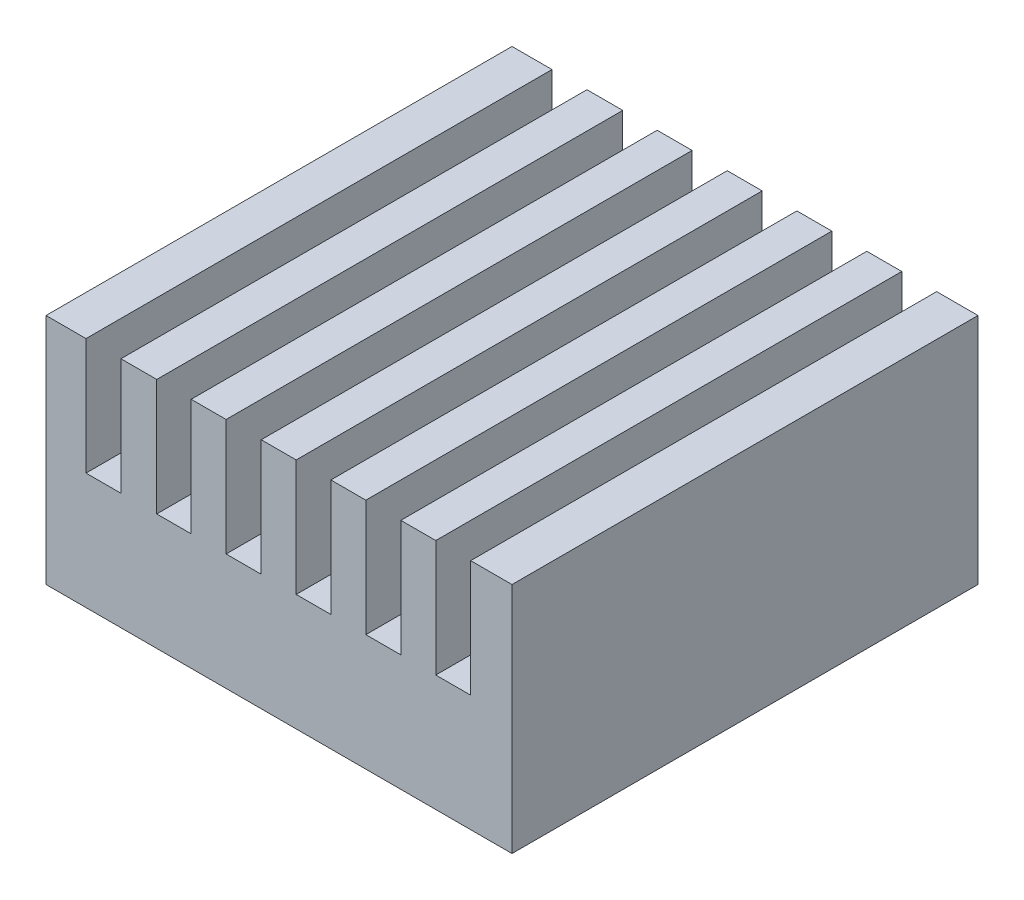
ISO-10303-21;
HEADER;
FILE_DESCRIPTION(('STEP AP214'),'2;1');
FILE_NAME('part.step','',(''),(''),'','','');
FILE_SCHEMA(('AUTOMOTIVE_DESIGN { 1 0 10303 214 1 1 1 1 }'));
ENDSEC;
DATA;
#1=APPLICATION_CONTEXT('core data for automotive mechanical design processes');
#2=APPLICATION_PROTOCOL_DEFINITION('international standard','automotive_design',2000,#1);
#3=PRODUCT_CONTEXT('',#1,'mechanical');
#4=PRODUCT('Part','Part','',(#3));
#5=PRODUCT_RELATED_PRODUCT_CATEGORY('part','',(#4));
#6=PRODUCT_DEFINITION_FORMATION('','',#4);
#7=PRODUCT_DEFINITION_CONTEXT('part definition',#1,'design');
#8=PRODUCT_DEFINITION('design','',#6,#7);
#9=PRODUCT_DEFINITION_SHAPE('','',#8);
#10=(LENGTH_UNIT() NAMED_UNIT(*) SI_UNIT(.MILLI.,.METRE.));
#11=(NAMED_UNIT(*) PLANE_ANGLE_UNIT() SI_UNIT($,.RADIAN.));
#12=(NAMED_UNIT(*) SI_UNIT($,.STERADIAN.) SOLID_ANGLE_UNIT());
#13=UNCERTAINTY_MEASURE_WITH_UNIT(LENGTH_MEASURE(1.E-05),#10,'distance_accuracy_value','');
#14=(GEOMETRIC_REPRESENTATION_CONTEXT(3) GLOBAL_UNCERTAINTY_ASSIGNED_CONTEXT((#13)) GLOBAL_UNIT_ASSIGNED_CONTEXT((#10,
#11,#12)) REPRESENTATION_CONTEXT('',''));
#15=CARTESIAN_POINT('',(0.,0.,0.));
#16=DIRECTION('',(0.,0.,1.));
#17=DIRECTION('',(1.,0.,0.));
#18=AXIS2_PLACEMENT_3D('',#15,#16,#17);
#19=CARTESIAN_POINT('',(28.5340033040011,10.4898974340159,35.0441058699852));
#20=DIRECTION('',(0.,1.,0.));
#21=DIRECTION('',(1.,0.,0.));
#22=AXIS2_PLACEMENT_3D('',#19,#20,#21);
#23=PLANE('',#22);
#24=DIRECTION('',(-1.,0.,0.));
#25=VECTOR('',#24,1.);
#26=CARTESIAN_POINT('',(8.53400330400107,10.4898974340159,15.0441058699852));
#27=LINE('',#26,#25);
#28=CARTESIAN_POINT('',(48.5340033040011,10.4898974340159,15.0441058699852));
#29=VERTEX_POINT('',#28);
#30=CARTESIAN_POINT('',(8.53400330400107,10.4898974340159,15.0441058699852));
#31=VERTEX_POINT('',#30);
#32=EDGE_CURVE('E21',#29,#31,#27,.T.);
#33=ORIENTED_EDGE('',*,*,#32,.F.);
#34=DIRECTION('',(0.,0.,-1.));
#35=VECTOR('',#34,1.);
#36=CARTESIAN_POINT('',(48.5340033040011,10.4898974340159,55.0441058699852));
#37=LINE('',#36,#35);
#38=CARTESIAN_POINT('',(48.5340033040011,10.4898974340159,55.0441058699852));
#39=VERTEX_POINT('',#38);
#40=EDGE_CURVE('E349',#39,#29,#37,.T.);
#41=ORIENTED_EDGE('',*,*,#40,.F.);
#42=DIRECTION('',(1.,0.,0.));
#43=VECTOR('',#42,1.);
#44=CARTESIAN_POINT('',(8.53400330400108,10.4898974340159,55.0441058699852));
#45=LINE('',#44,#43);
#46=CARTESIAN_POINT('',(8.53400330400108,10.4898974340159,55.0441058699852));
#47=VERTEX_POINT('',#46);
#48=EDGE_CURVE('E28',#47,#39,#45,.T.);
#49=ORIENTED_EDGE('',*,*,#48,.F.);
#50=DIRECTION('',(0.,0.,1.));
#51=VECTOR('',#50,1.);
#52=CARTESIAN_POINT('',(8.53400330400108,10.4898974340159,55.0441058699852));
#53=LINE('',#52,#51);
#54=EDGE_CURVE('E11',#31,#47,#53,.T.);
#55=ORIENTED_EDGE('',*,*,#54,.F.);
#56=EDGE_LOOP('',(#33,#41,#49,#55));
#57=FACE_BOUND('',#56,.T.);
#58=ADVANCED_FACE('F17',(#57),#23,.F.);
#59=CARTESIAN_POINT('',(28.5340033040011,30.4898974340159,35.0441058699852));
#60=DIRECTION('',(0.,1.,0.));
#61=DIRECTION('',(1.,0.,0.));
#62=AXIS2_PLACEMENT_3D('',#59,#60,#61);
#63=PLANE('',#62);
#64=DIRECTION('',(0.,0.,-1.));
#65=VECTOR('',#64,1.);
#66=CARTESIAN_POINT('',(23.9942961256802,30.4898974340159,25.0441058699852));
#67=LINE('',#66,#65);
#68=CARTESIAN_POINT('',(23.9942961256802,30.4898974340152,55.0441058699852));
#69=VERTEX_POINT('',#68);
#70=CARTESIAN_POINT('',(23.9942961256802,30.4898974340159,15.0441058699852));
#71=VERTEX_POINT('',#70);
#72=EDGE_CURVE('E509',#69,#71,#67,.T.);
#73=ORIENTED_EDGE('',*,*,#72,.T.);
#74=DIRECTION('',(-1.,0.,0.));
#75=VECTOR('',#74,1.);
#76=CARTESIAN_POINT('',(8.53400330400108,30.4898974340159,15.0441058699852));
#77=LINE('',#76,#75);
#78=CARTESIAN_POINT('',(20.9942961256802,30.4898974340152,15.0441058699852));
#79=VERTEX_POINT('',#78);
#80=EDGE_CURVE('E411',#71,#79,#77,.T.);
#81=ORIENTED_EDGE('',*,*,#80,.T.);
#82=DIRECTION('',(0.,0.,1.));
#83=VECTOR('',#82,1.);
#84=CARTESIAN_POINT('',(20.9942961256802,30.4898974340159,45.0441058699852));
#85=LINE('',#84,#83);
#86=CARTESIAN_POINT('',(20.9942961256802,30.4898974340152,55.0441058699852));
#87=VERTEX_POINT('',#86);
#88=EDGE_CURVE('E258',#79,#87,#85,.T.);
#89=ORIENTED_EDGE('',*,*,#88,.T.);
#90=DIRECTION('',(1.,0.,0.));
#91=VECTOR('',#90,1.);
#92=CARTESIAN_POINT('',(8.53400330400109,30.4898974340159,55.0441058699852));
#93=LINE('',#92,#91);
#94=EDGE_CURVE('E415',#87,#69,#93,.T.);
#95=ORIENTED_EDGE('',*,*,#94,.T.);
#96=EDGE_LOOP('',(#73,#81,#89,#95));
#97=FACE_BOUND('',#96,.T.);
#98=ADVANCED_FACE('F654',(#97),#63,.T.);
#99=CARTESIAN_POINT('',(8.53400330400108,10.4898974340159,15.0441058699852));
#100=DIRECTION('',(-1.,0.,0.));
#101=DIRECTION('',(0.,0.,1.));
#102=AXIS2_PLACEMENT_3D('',#99,#100,#101);
#103=PLANE('',#102);
#104=ORIENTED_EDGE('',*,*,#54,.T.);
#105=DIRECTION('',(0.,1.,0.));
#106=VECTOR('',#105,1.);
#107=CARTESIAN_POINT('',(8.53400330400108,10.4898974340159,55.0441058699852));
#108=LINE('',#107,#106);
#109=CARTESIAN_POINT('',(8.53400330400109,30.4898974340159,55.0441058699852));
#110=VERTEX_POINT('',#109);
#111=EDGE_CURVE('E359',#47,#110,#108,.T.);
#112=ORIENTED_EDGE('',*,*,#111,.T.);
#113=DIRECTION('',(0.,0.,1.));
#114=VECTOR('',#113,1.);
#115=CARTESIAN_POINT('',(8.53400330400109,30.4898974340159,55.0441058699852));
#116=LINE('',#115,#114);
#117=CARTESIAN_POINT('',(8.53400330400108,30.4898974340159,15.0441058699852));
#118=VERTEX_POINT('',#117);
#119=EDGE_CURVE('E340',#118,#110,#116,.T.);
#120=ORIENTED_EDGE('',*,*,#119,.F.);
#121=DIRECTION('',(0.,1.,0.));
#122=VECTOR('',#121,1.);
#123=CARTESIAN_POINT('',(8.53400330400107,10.4898974340159,15.0441058699852));
#124=LINE('',#123,#122);
#125=EDGE_CURVE('E294',#31,#118,#124,.T.);
#126=ORIENTED_EDGE('',*,*,#125,.F.);
#127=EDGE_LOOP('',(#104,#112,#120,#126));
#128=FACE_BOUND('',#127,.T.);
#129=ADVANCED_FACE('F917',(#128),#103,.T.);
#130=CARTESIAN_POINT('',(8.53400330400108,10.4898974340159,55.0441058699852));
#131=DIRECTION('',(0.,0.,1.));
#132=DIRECTION('',(1.,0.,0.));
#133=AXIS2_PLACEMENT_3D('',#130,#131,#132);
#134=PLANE('',#133);
#135=DIRECTION('',(0.,1.,0.));
#136=VECTOR('',#135,1.);
#137=CARTESIAN_POINT('',(23.9942961256801,15.4898974340159,55.0441058699852));
#138=LINE('',#137,#136);
#139=CARTESIAN_POINT('',(23.9942961256802,20.4898974340152,55.0441058699852));
#140=VERTEX_POINT('',#139);
#141=EDGE_CURVE('E463',#140,#69,#138,.T.);
#142=ORIENTED_EDGE('',*,*,#141,.T.);
#143=ORIENTED_EDGE('',*,*,#94,.F.);
#144=DIRECTION('',(0.,-1.,0.));
#145=VECTOR('',#144,1.);
#146=CARTESIAN_POINT('',(20.9942961256801,15.4898974340155,55.0441058699852));
#147=LINE('',#146,#145);
#148=CARTESIAN_POINT('',(20.9942961256802,20.4898974340152,55.0441058699852));
#149=VERTEX_POINT('',#148);
#150=EDGE_CURVE('E262',#87,#149,#147,.T.);
#151=ORIENTED_EDGE('',*,*,#150,.T.);
#152=DIRECTION('',(-1.,0.,0.));
#153=VECTOR('',#152,1.);
#154=CARTESIAN_POINT('',(14.0256667687704,20.4898974340159,55.0441058699852));
#155=LINE('',#154,#153);
#156=CARTESIAN_POINT('',(18.0403643413993,20.4898974340159,55.0441058699852));
#157=VERTEX_POINT('',#156);
#158=EDGE_CURVE('E264',#149,#157,#155,.T.);
#159=ORIENTED_EDGE('',*,*,#158,.T.);
#160=DIRECTION('',(0.,1.,0.));
#161=VECTOR('',#160,1.);
#162=CARTESIAN_POINT('',(18.0403643413993,15.4898974340159,55.0441058699852));
#163=LINE('',#162,#161);
#164=CARTESIAN_POINT('',(18.0403643413993,30.4898974340159,55.0441058699852));
#165=VERTEX_POINT('',#164);
#166=EDGE_CURVE('E366',#157,#165,#163,.T.);
#167=ORIENTED_EDGE('',*,*,#166,.T.);
#168=DIRECTION('',(1.,0.,0.));
#169=VECTOR('',#168,1.);
#170=CARTESIAN_POINT('',(8.53400330400109,30.4898974340159,55.0441058699852));
#171=LINE('',#170,#169);
#172=CARTESIAN_POINT('',(14.9676477439526,30.4898974340159,55.0441058699852));
#173=VERTEX_POINT('',#172);
#174=EDGE_CURVE('E345',#173,#165,#171,.T.);
#175=ORIENTED_EDGE('',*,*,#174,.F.);
#176=DIRECTION('',(0.,-1.,0.));
#177=VECTOR('',#176,1.);
#178=CARTESIAN_POINT('',(14.9676477439526,15.4898974340159,55.0441058699852));
#179=LINE('',#178,#177);
#180=CARTESIAN_POINT('',(14.9676477439526,20.4898974340159,55.0441058699852));
#181=VERTEX_POINT('',#180);
#182=EDGE_CURVE('E252',#173,#181,#179,.T.);
#183=ORIENTED_EDGE('',*,*,#182,.T.);
#184=DIRECTION('',(-1.,0.,0.));
#185=VECTOR('',#184,1.);
#186=CARTESIAN_POINT('',(11.0008255239768,20.4898974340159,55.0441058699852));
#187=LINE('',#186,#185);
#188=CARTESIAN_POINT('',(11.9676477439526,20.4898974340159,55.0441058699852));
#189=VERTEX_POINT('',#188);
#190=EDGE_CURVE('E396',#181,#189,#187,.T.);
#191=ORIENTED_EDGE('',*,*,#190,.T.);
#192=DIRECTION('',(0.,1.,0.));
#193=VECTOR('',#192,1.);
#194=CARTESIAN_POINT('',(11.9676477439526,15.4898974340159,55.0441058699852));
#195=LINE('',#194,#193);
#196=CARTESIAN_POINT('',(11.9676477439526,30.4898974340159,55.0441058699852));
#197=VERTEX_POINT('',#196);
#198=EDGE_CURVE('E253',#189,#197,#195,.T.);
#199=ORIENTED_EDGE('',*,*,#198,.T.);
#200=DIRECTION('',(1.,0.,0.));
#201=VECTOR('',#200,1.);
#202=CARTESIAN_POINT('',(8.53400330400109,30.4898974340159,55.0441058699852));
#203=LINE('',#202,#201);
#204=EDGE_CURVE('E344',#110,#197,#203,.T.);
#205=ORIENTED_EDGE('',*,*,#204,.F.);
#206=ORIENTED_EDGE('',*,*,#111,.F.);
#207=ORIENTED_EDGE('',*,*,#48,.T.);
#208=DIRECTION('',(0.,1.,0.));
#209=VECTOR('',#208,1.);
#210=CARTESIAN_POINT('',(48.5340033040011,10.4898974340159,55.0441058699852));
#211=LINE('',#210,#209);
#212=CARTESIAN_POINT('',(48.5340033040011,30.4898974340159,55.0441058699852));
#213=VERTEX_POINT('',#212);
#214=EDGE_CURVE('E352',#39,#213,#211,.T.);
#215=ORIENTED_EDGE('',*,*,#214,.T.);
#216=DIRECTION('',(1.,0.,0.));
#217=VECTOR('',#216,1.);
#218=CARTESIAN_POINT('',(8.53400330400109,30.4898974340159,55.0441058699852));
#219=LINE('',#218,#217);
#220=CARTESIAN_POINT('',(44.9859385745514,30.4898974340156,55.0441058699852));
#221=VERTEX_POINT('',#220);
#222=EDGE_CURVE('E388',#221,#213,#219,.T.);
#223=ORIENTED_EDGE('',*,*,#222,.F.);
#224=DIRECTION('',(0.,-1.,0.));
#225=VECTOR('',#224,1.);
#226=CARTESIAN_POINT('',(44.9859385745514,15.4898974340157,55.0441058699852));
#227=LINE('',#226,#225);
#228=CARTESIAN_POINT('',(44.9859385745514,20.4898974340156,55.0441058699852));
#229=VERTEX_POINT('',#228);
#230=EDGE_CURVE('E232',#221,#229,#227,.T.);
#231=ORIENTED_EDGE('',*,*,#230,.T.);
#232=DIRECTION('',(-1.,0.,0.));
#233=VECTOR('',#232,1.);
#234=CARTESIAN_POINT('',(26.0113039152153,20.4898974340159,55.0441058699852));
#235=LINE('',#234,#233);
#236=CARTESIAN_POINT('',(41.9912704783078,20.4898974340157,55.0441058699852));
#237=VERTEX_POINT('',#236);
#238=EDGE_CURVE('E218',#229,#237,#235,.T.);
#239=ORIENTED_EDGE('',*,*,#238,.T.);
#240=DIRECTION('',(0.,1.,0.));
#241=VECTOR('',#240,1.);
#242=CARTESIAN_POINT('',(41.9912704783078,15.4898974340158,55.0441058699852));
#243=LINE('',#242,#241);
#244=CARTESIAN_POINT('',(41.9912704783078,30.4898974340157,55.0441058699852));
#245=VERTEX_POINT('',#244);
#246=EDGE_CURVE('E233',#237,#245,#243,.T.);
#247=ORIENTED_EDGE('',*,*,#246,.T.);
#248=DIRECTION('',(1.,0.,0.));
#249=VECTOR('',#248,1.);
#250=CARTESIAN_POINT('',(8.53400330400109,30.4898974340159,55.0441058699852));
#251=LINE('',#250,#249);
#252=CARTESIAN_POINT('',(38.9912704783078,30.4898974340157,55.0441058699852));
#253=VERTEX_POINT('',#252);
#254=EDGE_CURVE('E348',#253,#245,#251,.T.);
#255=ORIENTED_EDGE('',*,*,#254,.F.);
#256=DIRECTION('',(0.,-1.,0.));
#257=VECTOR('',#256,1.);
#258=CARTESIAN_POINT('',(38.9912704783078,15.4898974340158,55.0441058699852));
#259=LINE('',#258,#257);
#260=CARTESIAN_POINT('',(38.9912704783078,20.4898974340157,55.0441058699852));
#261=VERTEX_POINT('',#260);
#262=EDGE_CURVE('E312',#253,#261,#259,.T.);
#263=ORIENTED_EDGE('',*,*,#262,.T.);
#264=DIRECTION('',(-1.,0.,0.));
#265=VECTOR('',#264,1.);
#266=CARTESIAN_POINT('',(23.0116728195443,20.4898974340159,55.0441058699852));
#267=LINE('',#266,#265);
#268=CARTESIAN_POINT('',(35.9874141918673,20.4898974340159,55.0441058699852));
#269=VERTEX_POINT('',#268);
#270=EDGE_CURVE('E309',#261,#269,#267,.T.);
#271=ORIENTED_EDGE('',*,*,#270,.T.);
#272=DIRECTION('',(0.,1.,0.));
#273=VECTOR('',#272,1.);
#274=CARTESIAN_POINT('',(35.9874141918673,15.4898974340159,55.0441058699852));
#275=LINE('',#274,#273);
#276=CARTESIAN_POINT('',(35.9874141918673,30.4898974340159,55.0441058699852));
#277=VERTEX_POINT('',#276);
#278=EDGE_CURVE('E485',#269,#277,#275,.T.);
#279=ORIENTED_EDGE('',*,*,#278,.T.);
#280=DIRECTION('',(1.,0.,0.));
#281=VECTOR('',#280,1.);
#282=CARTESIAN_POINT('',(8.53400330400109,30.4898974340159,55.0441058699852));
#283=LINE('',#282,#281);
#284=CARTESIAN_POINT('',(32.9874141918673,30.4898974340159,55.0441058699852));
#285=VERTEX_POINT('',#284);
#286=EDGE_CURVE('E434',#285,#277,#283,.T.);
#287=ORIENTED_EDGE('',*,*,#286,.F.);
#288=DIRECTION('',(0.,-1.,0.));
#289=VECTOR('',#288,1.);
#290=CARTESIAN_POINT('',(32.9874141918673,15.4898974340159,55.0441058699852));
#291=LINE('',#290,#289);
#292=CARTESIAN_POINT('',(32.9874141918673,20.4898974340159,55.0441058699852));
#293=VERTEX_POINT('',#292);
#294=EDGE_CURVE('E455',#285,#293,#291,.T.);
#295=ORIENTED_EDGE('',*,*,#294,.T.);
#296=DIRECTION('',(-1.,0.,0.));
#297=VECTOR('',#296,1.);
#298=CARTESIAN_POINT('',(20.0160778580608,20.4898974340159,55.0441058699852));
#299=LINE('',#298,#297);
#300=CARTESIAN_POINT('',(30.0088906323739,20.4898974340159,55.0441058699852));
#301=VERTEX_POINT('',#300);
#302=EDGE_CURVE('E276',#293,#301,#299,.T.);
#303=ORIENTED_EDGE('',*,*,#302,.T.);
#304=DIRECTION('',(0.,1.,0.));
#305=VECTOR('',#304,1.);
#306=CARTESIAN_POINT('',(30.0088906323739,15.4898974340159,55.0441058699852));
#307=LINE('',#306,#305);
#308=CARTESIAN_POINT('',(30.0088906323739,30.4898974340159,55.0441058699852));
#309=VERTEX_POINT('',#308);
#310=EDGE_CURVE('E381',#301,#309,#307,.T.);
#311=ORIENTED_EDGE('',*,*,#310,.T.);
#312=DIRECTION('',(1.,0.,0.));
#313=VECTOR('',#312,1.);
#314=CARTESIAN_POINT('',(8.53400330400109,30.4898974340159,55.0441058699852));
#315=LINE('',#314,#313);
#316=CARTESIAN_POINT('',(27.0088906323739,30.4898974340159,55.0441058699852));
#317=VERTEX_POINT('',#316);
#318=EDGE_CURVE('E431',#317,#309,#315,.T.);
#319=ORIENTED_EDGE('',*,*,#318,.F.);
#320=DIRECTION('',(0.,-1.,0.));
#321=VECTOR('',#320,1.);
#322=CARTESIAN_POINT('',(27.0088906323739,15.4898974340159,55.0441058699852));
#323=LINE('',#322,#321);
#324=CARTESIAN_POINT('',(27.0088906323739,20.4898974340159,55.0441058699852));
#325=VERTEX_POINT('',#324);
#326=EDGE_CURVE('E365',#317,#325,#323,.T.);
#327=ORIENTED_EDGE('',*,*,#326,.T.);
#328=DIRECTION('',(-1.,0.,0.));
#329=VECTOR('',#328,1.);
#330=CARTESIAN_POINT('',(17.0177983415141,20.4898974340159,55.0441058699852));
#331=LINE('',#330,#329);
#332=EDGE_CURVE('E377',#325,#140,#331,.T.);
#333=ORIENTED_EDGE('',*,*,#332,.T.);
#334=EDGE_LOOP('',(#142,#143,#151,#159,#167,#175,#183,#191,#199,#205,#206,#207,#215,#223,#231,
#239,#247,#255,#263,#271,#279,#287,#295,#303,#311,#319,#327,#333));
#335=FACE_BOUND('',#334,.T.);
#336=ADVANCED_FACE('F576',(#335),#134,.T.);
#337=CARTESIAN_POINT('',(48.5340033040011,10.4898974340159,55.0441058699852));
#338=DIRECTION('',(1.,0.,0.));
#339=DIRECTION('',(0.,-1.,0.));
#340=AXIS2_PLACEMENT_3D('',#337,#338,#339);
#341=PLANE('',#340);
#342=ORIENTED_EDGE('',*,*,#40,.T.);
#343=DIRECTION('',(0.,1.,0.));
#344=VECTOR('',#343,1.);
#345=CARTESIAN_POINT('',(48.5340033040011,10.4898974340159,15.0441058699852));
#346=LINE('',#345,#344);
#347=CARTESIAN_POINT('',(48.5340033040011,30.4898974340159,15.0441058699852));
#348=VERTEX_POINT('',#347);
#349=EDGE_CURVE('E471',#29,#348,#346,.T.);
#350=ORIENTED_EDGE('',*,*,#349,.T.);
#351=DIRECTION('',(0.,0.,-1.));
#352=VECTOR('',#351,1.);
#353=CARTESIAN_POINT('',(48.5340033040011,30.4898974340159,55.0441058699852));
#354=LINE('',#353,#352);
#355=EDGE_CURVE('E353',#213,#348,#354,.T.);
#356=ORIENTED_EDGE('',*,*,#355,.F.);
#357=ORIENTED_EDGE('',*,*,#214,.F.);
#358=EDGE_LOOP('',(#342,#350,#356,#357));
#359=FACE_BOUND('',#358,.T.);
#360=ADVANCED_FACE('F580',(#359),#341,.T.);
#361=CARTESIAN_POINT('',(28.5340033040011,30.4898974340159,35.0441058699852));
#362=DIRECTION('',(0.,1.,0.));
#363=DIRECTION('',(1.,0.,0.));
#364=AXIS2_PLACEMENT_3D('',#361,#362,#363);
#365=PLANE('',#364);
#366=DIRECTION('',(0.,0.,1.));
#367=VECTOR('',#366,1.);
#368=CARTESIAN_POINT('',(44.9859385745514,30.4898974340159,45.0441058699852));
#369=LINE('',#368,#367);
#370=CARTESIAN_POINT('',(44.9859385745514,30.4898974340155,15.0441058699852));
#371=VERTEX_POINT('',#370);
#372=EDGE_CURVE('E226',#371,#221,#369,.T.);
#373=ORIENTED_EDGE('',*,*,#372,.T.);
#374=ORIENTED_EDGE('',*,*,#222,.T.);
#375=ORIENTED_EDGE('',*,*,#355,.T.);
#376=DIRECTION('',(-1.,0.,0.));
#377=VECTOR('',#376,1.);
#378=CARTESIAN_POINT('',(8.53400330400108,30.4898974340159,15.0441058699852));
#379=LINE('',#378,#377);
#380=EDGE_CURVE('E474',#348,#371,#379,.T.);
#381=ORIENTED_EDGE('',*,*,#380,.T.);
#382=EDGE_LOOP('',(#373,#374,#375,#381));
#383=FACE_BOUND('',#382,.T.);
#384=ADVANCED_FACE('F583',(#383),#365,.T.);
#385=CARTESIAN_POINT('',(28.5340033040011,30.4898974340159,35.0441058699852));
#386=DIRECTION('',(0.,1.,0.));
#387=DIRECTION('',(1.,0.,0.));
#388=AXIS2_PLACEMENT_3D('',#385,#386,#387);
#389=PLANE('',#388);
#390=DIRECTION('',(0.,0.,1.));
#391=VECTOR('',#390,1.);
#392=CARTESIAN_POINT('',(27.0088906323739,30.4898974340159,45.0441058699852));
#393=LINE('',#392,#391);
#394=CARTESIAN_POINT('',(27.0088906323739,30.4898974340159,15.0441058699852));
#395=VERTEX_POINT('',#394);
#396=EDGE_CURVE('E360',#395,#317,#393,.T.);
#397=ORIENTED_EDGE('',*,*,#396,.T.);
#398=ORIENTED_EDGE('',*,*,#318,.T.);
#399=DIRECTION('',(0.,0.,-1.));
#400=VECTOR('',#399,1.);
#401=CARTESIAN_POINT('',(30.0088906323739,30.4898974340159,25.0441058699852));
#402=LINE('',#401,#400);
#403=CARTESIAN_POINT('',(30.0088906323739,30.4898974340159,15.0441058699852));
#404=VERTEX_POINT('',#403);
#405=EDGE_CURVE('E330',#309,#404,#402,.T.);
#406=ORIENTED_EDGE('',*,*,#405,.T.);
#407=DIRECTION('',(-1.,0.,0.));
#408=VECTOR('',#407,1.);
#409=CARTESIAN_POINT('',(8.53400330400108,30.4898974340159,15.0441058699852));
#410=LINE('',#409,#408);
#411=EDGE_CURVE('E395',#404,#395,#410,.T.);
#412=ORIENTED_EDGE('',*,*,#411,.T.);
#413=EDGE_LOOP('',(#397,#398,#406,#412));
#414=FACE_BOUND('',#413,.T.);
#415=ADVANCED_FACE('F940',(#414),#389,.T.);
#416=CARTESIAN_POINT('',(28.5340033040011,30.4898974340159,35.0441058699852));
#417=DIRECTION('',(0.,1.,0.));
#418=DIRECTION('',(1.,0.,0.));
#419=AXIS2_PLACEMENT_3D('',#416,#417,#418);
#420=PLANE('',#419);
#421=DIRECTION('',(0.,0.,1.));
#422=VECTOR('',#421,1.);
#423=CARTESIAN_POINT('',(32.9874141918673,30.4898974340159,45.0441058699852));
#424=LINE('',#423,#422);
#425=CARTESIAN_POINT('',(32.9874141918673,30.4898974340159,15.0441058699852));
#426=VERTEX_POINT('',#425);
#427=EDGE_CURVE('E428',#426,#285,#424,.T.);
#428=ORIENTED_EDGE('',*,*,#427,.T.);
#429=ORIENTED_EDGE('',*,*,#286,.T.);
#430=DIRECTION('',(0.,0.,-1.));
#431=VECTOR('',#430,1.);
#432=CARTESIAN_POINT('',(35.9874141918673,30.4898974340159,25.0441058699852));
#433=LINE('',#432,#431);
#434=CARTESIAN_POINT('',(35.9874141918673,30.4898974340159,15.0441058699852));
#435=VERTEX_POINT('',#434);
#436=EDGE_CURVE('E246',#277,#435,#433,.T.);
#437=ORIENTED_EDGE('',*,*,#436,.T.);
#438=DIRECTION('',(-1.,0.,0.));
#439=VECTOR('',#438,1.);
#440=CARTESIAN_POINT('',(8.53400330400108,30.4898974340159,15.0441058699852));
#441=LINE('',#440,#439);
#442=EDGE_CURVE('E470',#435,#426,#441,.T.);
#443=ORIENTED_EDGE('',*,*,#442,.T.);
#444=EDGE_LOOP('',(#428,#429,#437,#443));
#445=FACE_BOUND('',#444,.T.);
#446=ADVANCED_FACE('F880',(#445),#420,.T.);
#447=CARTESIAN_POINT('',(28.5340033040011,30.4898974340159,35.0441058699852));
#448=DIRECTION('',(0.,1.,0.));
#449=DIRECTION('',(1.,0.,0.));
#450=AXIS2_PLACEMENT_3D('',#447,#448,#449);
#451=PLANE('',#450);
#452=DIRECTION('',(0.,0.,-1.));
#453=VECTOR('',#452,1.);
#454=CARTESIAN_POINT('',(41.9912704783078,30.4898974340159,25.0441058699852));
#455=LINE('',#454,#453);
#456=CARTESIAN_POINT('',(41.9912704783078,30.4898974340157,15.0441058699852));
#457=VERTEX_POINT('',#456);
#458=EDGE_CURVE('E242',#245,#457,#455,.T.);
#459=ORIENTED_EDGE('',*,*,#458,.T.);
#460=DIRECTION('',(-1.,0.,0.));
#461=VECTOR('',#460,1.);
#462=CARTESIAN_POINT('',(8.53400330400108,30.4898974340159,15.0441058699852));
#463=LINE('',#462,#461);
#464=CARTESIAN_POINT('',(38.9912704783078,30.4898974340159,15.0441058699852));
#465=VERTEX_POINT('',#464);
#466=EDGE_CURVE('E324',#457,#465,#463,.T.);
#467=ORIENTED_EDGE('',*,*,#466,.T.);
#468=DIRECTION('',(0.,0.,1.));
#469=VECTOR('',#468,1.);
#470=CARTESIAN_POINT('',(38.9912704783078,30.4898974340159,45.0441058699852));
#471=LINE('',#470,#469);
#472=EDGE_CURVE('E302',#465,#253,#471,.T.);
#473=ORIENTED_EDGE('',*,*,#472,.T.);
#474=ORIENTED_EDGE('',*,*,#254,.T.);
#475=EDGE_LOOP('',(#459,#467,#473,#474));
#476=FACE_BOUND('',#475,.T.);
#477=ADVANCED_FACE('F589',(#476),#451,.T.);
#478=CARTESIAN_POINT('',(28.5340033040011,30.4898974340159,35.0441058699852));
#479=DIRECTION('',(0.,1.,0.));
#480=DIRECTION('',(1.,0.,0.));
#481=AXIS2_PLACEMENT_3D('',#478,#479,#480);
#482=PLANE('',#481);
#483=DIRECTION('',(0.,0.,-1.));
#484=VECTOR('',#483,1.);
#485=CARTESIAN_POINT('',(11.9676477439526,30.4898974340159,25.0441058699852));
#486=LINE('',#485,#484);
#487=CARTESIAN_POINT('',(11.9676477439526,30.4898974340159,15.0441058699852));
#488=VERTEX_POINT('',#487);
#489=EDGE_CURVE('E334',#197,#488,#486,.T.);
#490=ORIENTED_EDGE('',*,*,#489,.T.);
#491=DIRECTION('',(-1.,0.,0.));
#492=VECTOR('',#491,1.);
#493=CARTESIAN_POINT('',(8.53400330400108,30.4898974340159,15.0441058699852));
#494=LINE('',#493,#492);
#495=EDGE_CURVE('E297',#488,#118,#494,.T.);
#496=ORIENTED_EDGE('',*,*,#495,.T.);
#497=ORIENTED_EDGE('',*,*,#119,.T.);
#498=ORIENTED_EDGE('',*,*,#204,.T.);
#499=EDGE_LOOP('',(#490,#496,#497,#498));
#500=FACE_BOUND('',#499,.T.);
#501=ADVANCED_FACE('F619',(#500),#482,.T.);
#502=CARTESIAN_POINT('',(28.5340033040011,30.4898974340159,35.0441058699852));
#503=DIRECTION('',(0.,1.,0.));
#504=DIRECTION('',(1.,0.,0.));
#505=AXIS2_PLACEMENT_3D('',#502,#503,#504);
#506=PLANE('',#505);
#507=DIRECTION('',(0.,0.,-1.));
#508=VECTOR('',#507,1.);
#509=CARTESIAN_POINT('',(18.0403643413993,30.4898974340159,25.0441058699852));
#510=LINE('',#509,#508);
#511=CARTESIAN_POINT('',(18.0403643413993,30.4898974340159,15.0441058699852));
#512=VERTEX_POINT('',#511);
#513=EDGE_CURVE('E370',#165,#512,#510,.T.);
#514=ORIENTED_EDGE('',*,*,#513,.T.);
#515=DIRECTION('',(-1.,0.,0.));
#516=VECTOR('',#515,1.);
#517=CARTESIAN_POINT('',(8.53400330400108,30.4898974340159,15.0441058699852));
#518=LINE('',#517,#516);
#519=CARTESIAN_POINT('',(14.9676477439526,30.4898974340159,15.0441058699852));
#520=VERTEX_POINT('',#519);
#521=EDGE_CURVE('E408',#512,#520,#518,.T.);
#522=ORIENTED_EDGE('',*,*,#521,.T.);
#523=DIRECTION('',(0.,0.,1.));
#524=VECTOR('',#523,1.);
#525=CARTESIAN_POINT('',(14.9676477439526,30.4898974340159,45.0441058699852));
#526=LINE('',#525,#524);
#527=EDGE_CURVE('E293',#520,#173,#526,.T.);
#528=ORIENTED_EDGE('',*,*,#527,.T.);
#529=ORIENTED_EDGE('',*,*,#174,.T.);
#530=EDGE_LOOP('',(#514,#522,#528,#529));
#531=FACE_BOUND('',#530,.T.);
#532=ADVANCED_FACE('F853',(#531),#506,.T.);
#533=CARTESIAN_POINT('',(48.5340033040011,10.4898974340159,15.0441058699852));
#534=DIRECTION('',(0.,0.,-1.));
#535=DIRECTION('',(-1.,0.,0.));
#536=AXIS2_PLACEMENT_3D('',#533,#534,#535);
#537=PLANE('',#536);
#538=DIRECTION('',(0.,-1.,0.));
#539=VECTOR('',#538,1.);
#540=CARTESIAN_POINT('',(23.9942961256801,15.4898974340159,15.0441058699852));
#541=LINE('',#540,#539);
#542=CARTESIAN_POINT('',(23.9942961256802,20.4898974340159,15.0441058699852));
#543=VERTEX_POINT('',#542);
#544=EDGE_CURVE('E424',#71,#543,#541,.T.);
#545=ORIENTED_EDGE('',*,*,#544,.T.);
#546=DIRECTION('',(1.,0.,0.));
#547=VECTOR('',#546,1.);
#548=CARTESIAN_POINT('',(37.017798341514,20.4898974340166,15.0441058699852));
#549=LINE('',#548,#547);
#550=CARTESIAN_POINT('',(27.0088906323739,20.4898974340159,15.0441058699852));
#551=VERTEX_POINT('',#550);
#552=EDGE_CURVE('E257',#543,#551,#549,.T.);
#553=ORIENTED_EDGE('',*,*,#552,.T.);
#554=DIRECTION('',(0.,1.,0.));
#555=VECTOR('',#554,1.);
#556=CARTESIAN_POINT('',(27.0088906323739,15.4898974340159,15.0441058699852));
#557=LINE('',#556,#555);
#558=EDGE_CURVE('E364',#551,#395,#557,.T.);
#559=ORIENTED_EDGE('',*,*,#558,.T.);
#560=ORIENTED_EDGE('',*,*,#411,.F.);
#561=DIRECTION('',(0.,-1.,0.));
#562=VECTOR('',#561,1.);
#563=CARTESIAN_POINT('',(30.0088906323739,15.4898974340159,15.0441058699852));
#564=LINE('',#563,#562);
#565=CARTESIAN_POINT('',(30.0088906323739,20.4898974340159,15.0441058699852));
#566=VERTEX_POINT('',#565);
#567=EDGE_CURVE('E326',#404,#566,#564,.T.);
#568=ORIENTED_EDGE('',*,*,#567,.T.);
#569=DIRECTION('',(1.,0.,0.));
#570=VECTOR('',#569,1.);
#571=CARTESIAN_POINT('',(40.0160778580608,20.4898974340159,15.0441058699852));
#572=LINE('',#571,#570);
#573=CARTESIAN_POINT('',(32.9874141918673,20.4898974340159,15.0441058699852));
#574=VERTEX_POINT('',#573);
#575=EDGE_CURVE('E272',#566,#574,#572,.T.);
#576=ORIENTED_EDGE('',*,*,#575,.T.);
#577=DIRECTION('',(0.,1.,0.));
#578=VECTOR('',#577,1.);
#579=CARTESIAN_POINT('',(32.9874141918673,15.4898974340159,15.0441058699852));
#580=LINE('',#579,#578);
#581=EDGE_CURVE('E277',#574,#426,#580,.T.);
#582=ORIENTED_EDGE('',*,*,#581,.T.);
#583=ORIENTED_EDGE('',*,*,#442,.F.);
#584=DIRECTION('',(0.,-1.,0.));
#585=VECTOR('',#584,1.);
#586=CARTESIAN_POINT('',(35.9874141918673,15.4898974340159,15.0441058699852));
#587=LINE('',#586,#585);
#588=CARTESIAN_POINT('',(35.9874141918673,20.4898974340159,15.0441058699852));
#589=VERTEX_POINT('',#588);
#590=EDGE_CURVE('E479',#435,#589,#587,.T.);
#591=ORIENTED_EDGE('',*,*,#590,.T.);
#592=DIRECTION('',(1.,0.,0.));
#593=VECTOR('',#592,1.);
#594=CARTESIAN_POINT('',(43.0116728195443,20.4898974340159,15.0441058699852));
#595=LINE('',#594,#593);
#596=CARTESIAN_POINT('',(38.9912704783078,20.4898974340159,15.0441058699852));
#597=VERTEX_POINT('',#596);
#598=EDGE_CURVE('E301',#589,#597,#595,.T.);
#599=ORIENTED_EDGE('',*,*,#598,.T.);
#600=DIRECTION('',(0.,1.,0.));
#601=VECTOR('',#600,1.);
#602=CARTESIAN_POINT('',(38.9912704783078,15.4898974340158,15.0441058699852));
#603=LINE('',#602,#601);
#604=EDGE_CURVE('E298',#597,#465,#603,.T.);
#605=ORIENTED_EDGE('',*,*,#604,.T.);
#606=ORIENTED_EDGE('',*,*,#466,.F.);
#607=DIRECTION('',(0.,-1.,0.));
#608=VECTOR('',#607,1.);
#609=CARTESIAN_POINT('',(41.9912704783078,15.4898974340158,15.0441058699852));
#610=LINE('',#609,#608);
#611=CARTESIAN_POINT('',(41.9912704783078,20.4898974340157,15.0441058699852));
#612=VERTEX_POINT('',#611);
#613=EDGE_CURVE('E212',#457,#612,#610,.T.);
#614=ORIENTED_EDGE('',*,*,#613,.T.);
#615=DIRECTION('',(1.,0.,0.));
#616=VECTOR('',#615,1.);
#617=CARTESIAN_POINT('',(46.0113039152153,20.4898974340159,15.0441058699852));
#618=LINE('',#617,#616);
#619=CARTESIAN_POINT('',(44.9859385745514,20.4898974340155,15.0441058699852));
#620=VERTEX_POINT('',#619);
#621=EDGE_CURVE('E204',#612,#620,#618,.T.);
#622=ORIENTED_EDGE('',*,*,#621,.T.);
#623=DIRECTION('',(0.,1.,0.));
#624=VECTOR('',#623,1.);
#625=CARTESIAN_POINT('',(44.9859385745514,15.4898974340157,15.0441058699852));
#626=LINE('',#625,#624);
#627=EDGE_CURVE('E209',#620,#371,#626,.T.);
#628=ORIENTED_EDGE('',*,*,#627,.T.);
#629=ORIENTED_EDGE('',*,*,#380,.F.);
#630=ORIENTED_EDGE('',*,*,#349,.F.);
#631=ORIENTED_EDGE('',*,*,#32,.T.);
#632=ORIENTED_EDGE('',*,*,#125,.T.);
#633=ORIENTED_EDGE('',*,*,#495,.F.);
#634=DIRECTION('',(0.,-1.,0.));
#635=VECTOR('',#634,1.);
#636=CARTESIAN_POINT('',(11.9676477439526,15.4898974340159,15.0441058699852));
#637=LINE('',#636,#635);
#638=CARTESIAN_POINT('',(11.9676477439526,20.4898974340159,15.0441058699852));
#639=VERTEX_POINT('',#638);
#640=EDGE_CURVE('E392',#488,#639,#637,.T.);
#641=ORIENTED_EDGE('',*,*,#640,.T.);
#642=DIRECTION('',(1.,0.,0.));
#643=VECTOR('',#642,1.);
#644=CARTESIAN_POINT('',(31.0008255239768,20.4898974340159,15.0441058699852));
#645=LINE('',#644,#643);
#646=CARTESIAN_POINT('',(14.9676477439526,20.4898974340159,15.0441058699852));
#647=VERTEX_POINT('',#646);
#648=EDGE_CURVE('E393',#639,#647,#645,.T.);
#649=ORIENTED_EDGE('',*,*,#648,.T.);
#650=DIRECTION('',(0.,1.,0.));
#651=VECTOR('',#650,1.);
#652=CARTESIAN_POINT('',(14.9676477439526,15.4898974340159,15.0441058699852));
#653=LINE('',#652,#651);
#654=EDGE_CURVE('E404',#647,#520,#653,.T.);
#655=ORIENTED_EDGE('',*,*,#654,.T.);
#656=ORIENTED_EDGE('',*,*,#521,.F.);
#657=DIRECTION('',(0.,-1.,0.));
#658=VECTOR('',#657,1.);
#659=CARTESIAN_POINT('',(18.0403643413993,15.4898974340159,15.0441058699852));
#660=LINE('',#659,#658);
#661=CARTESIAN_POINT('',(18.0403643413993,20.4898974340159,15.0441058699852));
#662=VERTEX_POINT('',#661);
#663=EDGE_CURVE('E339',#512,#662,#660,.T.);
#664=ORIENTED_EDGE('',*,*,#663,.T.);
#665=DIRECTION('',(1.,0.,0.));
#666=VECTOR('',#665,1.);
#667=CARTESIAN_POINT('',(34.0256667687704,20.4898974340159,15.0441058699852));
#668=LINE('',#667,#666);
#669=CARTESIAN_POINT('',(20.9942961256802,20.4898974340152,15.0441058699852));
#670=VERTEX_POINT('',#669);
#671=EDGE_CURVE('E268',#662,#670,#668,.T.);
#672=ORIENTED_EDGE('',*,*,#671,.T.);
#673=DIRECTION('',(0.,1.,0.));
#674=VECTOR('',#673,1.);
#675=CARTESIAN_POINT('',(20.9942961256802,15.4898974340155,15.0441058699852));
#676=LINE('',#675,#674);
#677=EDGE_CURVE('E261',#670,#79,#676,.T.);
#678=ORIENTED_EDGE('',*,*,#677,.T.);
#679=ORIENTED_EDGE('',*,*,#80,.F.);
#680=EDGE_LOOP('',(#545,#553,#559,#560,#568,#576,#582,#583,#591,#599,#605,#606,#614,#622,#628,
#629,#630,#631,#632,#633,#641,#649,#655,#656,#664,#672,#678,#679));
#681=FACE_BOUND('',#680,.T.);
#682=ADVANCED_FACE('F207',(#681),#537,.T.);
#683=CARTESIAN_POINT('',(13.4676477439526,20.4898974340159,35.0441058699852));
#684=DIRECTION('',(0.,1.,0.));
#685=DIRECTION('',(0.,0.,-1.));
#686=AXIS2_PLACEMENT_3D('',#683,#684,#685);
#687=PLANE('',#686);
#688=ORIENTED_EDGE('',*,*,#190,.F.);
#689=DIRECTION('',(0.,0.,1.));
#690=VECTOR('',#689,1.);
#691=CARTESIAN_POINT('',(14.9676477439526,20.4898974340159,15.0441058699852));
#692=LINE('',#691,#690);
#693=EDGE_CURVE('E248',#647,#181,#692,.T.);
#694=ORIENTED_EDGE('',*,*,#693,.F.);
#695=ORIENTED_EDGE('',*,*,#648,.F.);
#696=DIRECTION('',(0.,0.,-1.));
#697=VECTOR('',#696,1.);
#698=CARTESIAN_POINT('',(11.9676477439526,20.4898974340159,55.0441058699852));
#699=LINE('',#698,#697);
#700=EDGE_CURVE('E419',#189,#639,#699,.T.);
#701=ORIENTED_EDGE('',*,*,#700,.F.);
#702=EDGE_LOOP('',(#688,#694,#695,#701));
#703=FACE_BOUND('',#702,.T.);
#704=ADVANCED_FACE('F614',(#703),#687,.T.);
#705=CARTESIAN_POINT('',(14.9676477439526,20.4898974340159,55.0441058699852));
#706=DIRECTION('',(1.,0.,0.));
#707=DIRECTION('',(0.,-1.,0.));
#708=AXIS2_PLACEMENT_3D('',#705,#706,#707);
#709=PLANE('',#708);
#710=ORIENTED_EDGE('',*,*,#693,.T.);
#711=ORIENTED_EDGE('',*,*,#182,.F.);
#712=ORIENTED_EDGE('',*,*,#527,.F.);
#713=ORIENTED_EDGE('',*,*,#654,.F.);
#714=EDGE_LOOP('',(#710,#711,#712,#713));
#715=FACE_BOUND('',#714,.T.);
#716=ADVANCED_FACE('F624',(#715),#709,.F.);
#717=CARTESIAN_POINT('',(11.9676477439526,20.4898974340159,15.0441058699852));
#718=DIRECTION('',(-1.,0.,0.));
#719=DIRECTION('',(0.,0.,1.));
#720=AXIS2_PLACEMENT_3D('',#717,#718,#719);
#721=PLANE('',#720);
#722=ORIENTED_EDGE('',*,*,#700,.T.);
#723=ORIENTED_EDGE('',*,*,#640,.F.);
#724=ORIENTED_EDGE('',*,*,#489,.F.);
#725=ORIENTED_EDGE('',*,*,#198,.F.);
#726=EDGE_LOOP('',(#722,#723,#724,#725));
#727=FACE_BOUND('',#726,.T.);
#728=ADVANCED_FACE('F611',(#727),#721,.F.);
#729=CARTESIAN_POINT('',(37.4893423350875,20.4898974340159,35.0441058699852));
#730=DIRECTION('',(0.,1.,0.));
#731=DIRECTION('',(1.,0.,0.));
#732=AXIS2_PLACEMENT_3D('',#729,#730,#731);
#733=PLANE('',#732);
#734=DIRECTION('',(0.,0.,-1.));
#735=VECTOR('',#734,1.);
#736=CARTESIAN_POINT('',(38.9912704783078,20.4898974340157,55.0441058699852));
#737=LINE('',#736,#735);
#738=EDGE_CURVE('E320',#261,#597,#737,.T.);
#739=ORIENTED_EDGE('',*,*,#738,.T.);
#740=ORIENTED_EDGE('',*,*,#598,.F.);
#741=DIRECTION('',(0.,0.,1.));
#742=VECTOR('',#741,1.);
#743=CARTESIAN_POINT('',(35.9874141918673,20.4898974340159,15.0441058699852));
#744=LINE('',#743,#742);
#745=EDGE_CURVE('E281',#589,#269,#744,.T.);
#746=ORIENTED_EDGE('',*,*,#745,.T.);
#747=ORIENTED_EDGE('',*,*,#270,.F.);
#748=EDGE_LOOP('',(#739,#740,#746,#747));
#749=FACE_BOUND('',#748,.T.);
#750=ADVANCED_FACE('F952',(#749),#733,.T.);
#751=CARTESIAN_POINT('',(38.9912704783078,20.4898974340157,55.0441058699852));
#752=DIRECTION('',(1.,0.,0.));
#753=DIRECTION('',(0.,-1.,0.));
#754=AXIS2_PLACEMENT_3D('',#751,#752,#753);
#755=PLANE('',#754);
#756=ORIENTED_EDGE('',*,*,#738,.F.);
#757=ORIENTED_EDGE('',*,*,#262,.F.);
#758=ORIENTED_EDGE('',*,*,#472,.F.);
#759=ORIENTED_EDGE('',*,*,#604,.F.);
#760=EDGE_LOOP('',(#756,#757,#758,#759));
#761=FACE_BOUND('',#760,.T.);
#762=ADVANCED_FACE('F594',(#761),#755,.F.);
#763=CARTESIAN_POINT('',(35.9874141918673,20.4898974340159,15.0441058699852));
#764=DIRECTION('',(-1.,0.,0.));
#765=DIRECTION('',(0.,0.,1.));
#766=AXIS2_PLACEMENT_3D('',#763,#764,#765);
#767=PLANE('',#766);
#768=ORIENTED_EDGE('',*,*,#745,.F.);
#769=ORIENTED_EDGE('',*,*,#590,.F.);
#770=ORIENTED_EDGE('',*,*,#436,.F.);
#771=ORIENTED_EDGE('',*,*,#278,.F.);
#772=EDGE_LOOP('',(#768,#769,#770,#771));
#773=FACE_BOUND('',#772,.T.);
#774=ADVANCED_FACE('F980',(#773),#767,.F.);
#775=CARTESIAN_POINT('',(31.4981524121206,20.4898974340159,35.0441058699852));
#776=DIRECTION('',(0.,1.,0.));
#777=DIRECTION('',(1.,0.,0.));
#778=AXIS2_PLACEMENT_3D('',#775,#776,#777);
#779=PLANE('',#778);
#780=DIRECTION('',(0.,0.,-1.));
#781=VECTOR('',#780,1.);
#782=CARTESIAN_POINT('',(32.9874141918673,20.4898974340159,55.0441058699852));
#783=LINE('',#782,#781);
#784=EDGE_CURVE('E492',#293,#574,#783,.T.);
#785=ORIENTED_EDGE('',*,*,#784,.T.);
#786=ORIENTED_EDGE('',*,*,#575,.F.);
#787=DIRECTION('',(0.,0.,1.));
#788=VECTOR('',#787,1.);
#789=CARTESIAN_POINT('',(30.0088906323739,20.4898974340159,15.0441058699852));
#790=LINE('',#789,#788);
#791=EDGE_CURVE('E267',#566,#301,#790,.T.);
#792=ORIENTED_EDGE('',*,*,#791,.T.);
#793=ORIENTED_EDGE('',*,*,#302,.F.);
#794=EDGE_LOOP('',(#785,#786,#792,#793));
#795=FACE_BOUND('',#794,.T.);
#796=ADVANCED_FACE('F891',(#795),#779,.T.);
#797=CARTESIAN_POINT('',(32.9874141918673,20.4898974340159,55.0441058699852));
#798=DIRECTION('',(1.,0.,0.));
#799=DIRECTION('',(0.,-1.,0.));
#800=AXIS2_PLACEMENT_3D('',#797,#798,#799);
#801=PLANE('',#800);
#802=ORIENTED_EDGE('',*,*,#784,.F.);
#803=ORIENTED_EDGE('',*,*,#294,.F.);
#804=ORIENTED_EDGE('',*,*,#427,.F.);
#805=ORIENTED_EDGE('',*,*,#581,.F.);
#806=EDGE_LOOP('',(#802,#803,#804,#805));
#807=FACE_BOUND('',#806,.T.);
#808=ADVANCED_FACE('F886',(#807),#801,.F.);
#809=CARTESIAN_POINT('',(30.0088906323739,20.4898974340159,15.0441058699852));
#810=DIRECTION('',(-1.,0.,0.));
#811=DIRECTION('',(0.,0.,1.));
#812=AXIS2_PLACEMENT_3D('',#809,#810,#811);
#813=PLANE('',#812);
#814=ORIENTED_EDGE('',*,*,#791,.F.);
#815=ORIENTED_EDGE('',*,*,#567,.F.);
#816=ORIENTED_EDGE('',*,*,#405,.F.);
#817=ORIENTED_EDGE('',*,*,#310,.F.);
#818=EDGE_LOOP('',(#814,#815,#816,#817));
#819=FACE_BOUND('',#818,.T.);
#820=ADVANCED_FACE('F863',(#819),#813,.F.);
#821=CARTESIAN_POINT('',(19.5173302335397,20.4898974340159,35.0441058699852));
#822=DIRECTION('',(0.,1.,0.));
#823=DIRECTION('',(1.,0.,0.));
#824=AXIS2_PLACEMENT_3D('',#821,#822,#823);
#825=PLANE('',#824);
#826=ORIENTED_EDGE('',*,*,#671,.F.);
#827=DIRECTION('',(0.,0.,-1.));
#828=VECTOR('',#827,1.);
#829=CARTESIAN_POINT('',(18.0403643413993,20.4898974340159,55.0441058699852));
#830=LINE('',#829,#828);
#831=EDGE_CURVE('E335',#157,#662,#830,.T.);
#832=ORIENTED_EDGE('',*,*,#831,.F.);
#833=ORIENTED_EDGE('',*,*,#158,.F.);
#834=DIRECTION('',(0.,0.,1.));
#835=VECTOR('',#834,1.);
#836=CARTESIAN_POINT('',(20.9942961256802,20.4898974340152,15.0441058699852));
#837=LINE('',#836,#835);
#838=EDGE_CURVE('E286',#670,#149,#837,.T.);
#839=ORIENTED_EDGE('',*,*,#838,.F.);
#840=EDGE_LOOP('',(#826,#832,#833,#839));
#841=FACE_BOUND('',#840,.T.);
#842=ADVANCED_FACE('F643',(#841),#825,.T.);
#843=CARTESIAN_POINT('',(18.0403643413993,20.4898974340159,15.0441058699852));
#844=DIRECTION('',(-1.,0.,0.));
#845=DIRECTION('',(0.,0.,1.));
#846=AXIS2_PLACEMENT_3D('',#843,#844,#845);
#847=PLANE('',#846);
#848=ORIENTED_EDGE('',*,*,#831,.T.);
#849=ORIENTED_EDGE('',*,*,#663,.F.);
#850=ORIENTED_EDGE('',*,*,#513,.F.);
#851=ORIENTED_EDGE('',*,*,#166,.F.);
#852=EDGE_LOOP('',(#848,#849,#850,#851));
#853=FACE_BOUND('',#852,.T.);
#854=ADVANCED_FACE('F649',(#853),#847,.F.);
#855=CARTESIAN_POINT('',(20.9942961256802,20.4898974340152,55.0441058699852));
#856=DIRECTION('',(1.,0.,0.));
#857=DIRECTION('',(0.,-1.,0.));
#858=AXIS2_PLACEMENT_3D('',#855,#856,#857);
#859=PLANE('',#858);
#860=ORIENTED_EDGE('',*,*,#838,.T.);
#861=ORIENTED_EDGE('',*,*,#150,.F.);
#862=ORIENTED_EDGE('',*,*,#88,.F.);
#863=ORIENTED_EDGE('',*,*,#677,.F.);
#864=EDGE_LOOP('',(#860,#861,#862,#863));
#865=FACE_BOUND('',#864,.T.);
#866=ADVANCED_FACE('F19',(#865),#859,.F.);
#867=CARTESIAN_POINT('',(43.4886045264296,20.4898974340159,35.0441058699852));
#868=DIRECTION('',(0.,1.,0.));
#869=DIRECTION('',(1.,0.,0.));
#870=AXIS2_PLACEMENT_3D('',#867,#868,#869);
#871=PLANE('',#870);
#872=DIRECTION('',(0.,0.,-1.));
#873=VECTOR('',#872,1.);
#874=CARTESIAN_POINT('',(44.9859385745514,20.4898974340156,55.0441058699852));
#875=LINE('',#874,#873);
#876=EDGE_CURVE('E224',#229,#620,#875,.T.);
#877=ORIENTED_EDGE('',*,*,#876,.T.);
#878=ORIENTED_EDGE('',*,*,#621,.F.);
#879=DIRECTION('',(0.,0.,1.));
#880=VECTOR('',#879,1.);
#881=CARTESIAN_POINT('',(41.9912704783078,20.4898974340157,15.0441058699852));
#882=LINE('',#881,#880);
#883=EDGE_CURVE('E254',#612,#237,#882,.T.);
#884=ORIENTED_EDGE('',*,*,#883,.T.);
#885=ORIENTED_EDGE('',*,*,#238,.F.);
#886=EDGE_LOOP('',(#877,#878,#884,#885));
#887=FACE_BOUND('',#886,.T.);
#888=ADVANCED_FACE('F229',(#887),#871,.T.);
#889=CARTESIAN_POINT('',(44.9859385745514,20.4898974340156,55.0441058699852));
#890=DIRECTION('',(1.,0.,0.));
#891=DIRECTION('',(0.,0.,-1.));
#892=AXIS2_PLACEMENT_3D('',#889,#890,#891);
#893=PLANE('',#892);
#894=ORIENTED_EDGE('',*,*,#876,.F.);
#895=ORIENTED_EDGE('',*,*,#230,.F.);
#896=ORIENTED_EDGE('',*,*,#372,.F.);
#897=ORIENTED_EDGE('',*,*,#627,.F.);
#898=EDGE_LOOP('',(#894,#895,#896,#897));
#899=FACE_BOUND('',#898,.T.);
#900=ADVANCED_FACE('F222',(#899),#893,.F.);
#901=CARTESIAN_POINT('',(41.9912704783078,20.4898974340157,15.0441058699852));
#902=DIRECTION('',(-1.,0.,0.));
#903=DIRECTION('',(0.,1.,0.));
#904=AXIS2_PLACEMENT_3D('',#901,#902,#903);
#905=PLANE('',#904);
#906=ORIENTED_EDGE('',*,*,#883,.F.);
#907=ORIENTED_EDGE('',*,*,#613,.F.);
#908=ORIENTED_EDGE('',*,*,#458,.F.);
#909=ORIENTED_EDGE('',*,*,#246,.F.);
#910=EDGE_LOOP('',(#906,#907,#908,#909));
#911=FACE_BOUND('',#910,.T.);
#912=ADVANCED_FACE('F588',(#911),#905,.F.);
#913=CARTESIAN_POINT('',(25.501593379027,20.4898974340162,35.0441058699852));
#914=DIRECTION('',(0.,1.,0.));
#915=DIRECTION('',(0.,0.,-1.));
#916=AXIS2_PLACEMENT_3D('',#913,#914,#915);
#917=PLANE('',#916);
#918=ORIENTED_EDGE('',*,*,#332,.F.);
#919=DIRECTION('',(0.,0.,-1.));
#920=VECTOR('',#919,1.);
#921=CARTESIAN_POINT('',(27.0088906323739,20.4898974340159,55.0441058699852));
#922=LINE('',#921,#920);
#923=EDGE_CURVE('E459',#325,#551,#922,.T.);
#924=ORIENTED_EDGE('',*,*,#923,.T.);
#925=ORIENTED_EDGE('',*,*,#552,.F.);
#926=DIRECTION('',(0.,0.,-1.));
#927=VECTOR('',#926,1.);
#928=CARTESIAN_POINT('',(23.9942961256802,20.4898974340152,55.0441058699852));
#929=LINE('',#928,#927);
#930=EDGE_CURVE('E420',#140,#543,#929,.T.);
#931=ORIENTED_EDGE('',*,*,#930,.F.);
#932=EDGE_LOOP('',(#918,#924,#925,#931));
#933=FACE_BOUND('',#932,.T.);
#934=ADVANCED_FACE('F526',(#933),#917,.T.);
#935=CARTESIAN_POINT('',(27.0088906323739,20.4898974340159,55.0441058699852));
#936=DIRECTION('',(1.,0.,0.));
#937=DIRECTION('',(0.,-1.,0.));
#938=AXIS2_PLACEMENT_3D('',#935,#936,#937);
#939=PLANE('',#938);
#940=ORIENTED_EDGE('',*,*,#923,.F.);
#941=ORIENTED_EDGE('',*,*,#326,.F.);
#942=ORIENTED_EDGE('',*,*,#396,.F.);
#943=ORIENTED_EDGE('',*,*,#558,.F.);
#944=EDGE_LOOP('',(#940,#941,#942,#943));
#945=FACE_BOUND('',#944,.T.);
#946=ADVANCED_FACE('F533',(#945),#939,.F.);
#947=CARTESIAN_POINT('',(23.9942961256802,20.4898974340159,15.0441058699852));
#948=DIRECTION('',(-1.,0.,0.));
#949=DIRECTION('',(0.,0.,1.));
#950=AXIS2_PLACEMENT_3D('',#947,#948,#949);
#951=PLANE('',#950);
#952=ORIENTED_EDGE('',*,*,#930,.T.);
#953=ORIENTED_EDGE('',*,*,#544,.F.);
#954=ORIENTED_EDGE('',*,*,#72,.F.);
#955=ORIENTED_EDGE('',*,*,#141,.F.);
#956=EDGE_LOOP('',(#952,#953,#954,#955));
#957=FACE_BOUND('',#956,.T.);
#958=ADVANCED_FACE('F523',(#957),#951,.F.);
#959=CLOSED_SHELL('',(#58,#98,#129,#336,#360,#384,#415,#446,#477,#501,#532,#682,#704,#716,#728,
#750,#762,#774,#796,#808,#820,#842,#854,#866,#888,#900,#912,#934,#946,#958));
#960=MANIFOLD_SOLID_BREP('B1',#959);
#961=ADVANCED_BREP_SHAPE_REPRESENTATION('',(#18,#960),#14);
#962=SHAPE_DEFINITION_REPRESENTATION(#9,#961);
ENDSEC;
END-ISO-10303-21;
